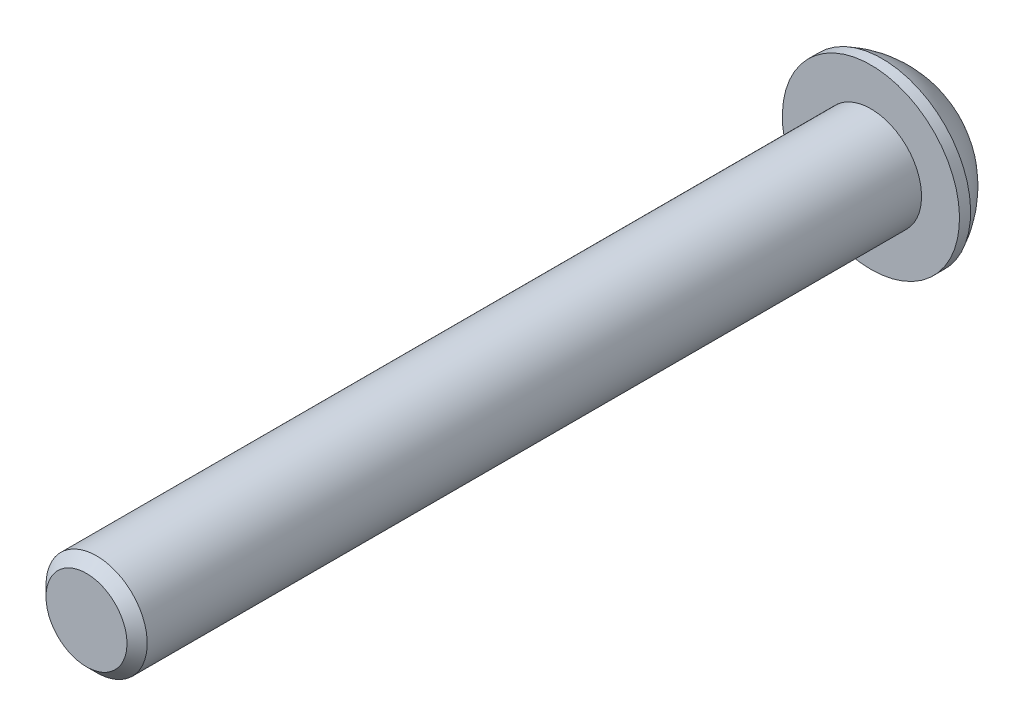
ISO-10303-21;
HEADER;
FILE_DESCRIPTION(('STEP AP214'),'2;1');
FILE_NAME('part.step','',(''),(''),'','','');
FILE_SCHEMA(('AUTOMOTIVE_DESIGN { 1 0 10303 214 1 1 1 1 }'));
ENDSEC;
DATA;
#1=APPLICATION_CONTEXT('core data for automotive mechanical design processes');
#2=APPLICATION_PROTOCOL_DEFINITION('international standard','automotive_design',2000,#1);
#3=PRODUCT_CONTEXT('',#1,'mechanical');
#4=PRODUCT('Part','Part','',(#3));
#5=PRODUCT_RELATED_PRODUCT_CATEGORY('part','',(#4));
#6=PRODUCT_DEFINITION_FORMATION('','',#4);
#7=PRODUCT_DEFINITION_CONTEXT('part definition',#1,'design');
#8=PRODUCT_DEFINITION('design','',#6,#7);
#9=PRODUCT_DEFINITION_SHAPE('','',#8);
#10=(LENGTH_UNIT() NAMED_UNIT(*) SI_UNIT(.MILLI.,.METRE.));
#11=(NAMED_UNIT(*) PLANE_ANGLE_UNIT() SI_UNIT($,.RADIAN.));
#12=(NAMED_UNIT(*) SI_UNIT($,.STERADIAN.) SOLID_ANGLE_UNIT());
#13=UNCERTAINTY_MEASURE_WITH_UNIT(LENGTH_MEASURE(1.E-05),#10,'distance_accuracy_value','');
#14=(GEOMETRIC_REPRESENTATION_CONTEXT(3) GLOBAL_UNCERTAINTY_ASSIGNED_CONTEXT((#13)) GLOBAL_UNIT_ASSIGNED_CONTEXT((#10,
#11,#12)) REPRESENTATION_CONTEXT('',''));
#15=CARTESIAN_POINT('',(0.,0.,0.));
#16=DIRECTION('',(0.,0.,1.));
#17=DIRECTION('',(1.,0.,0.));
#18=AXIS2_PLACEMENT_3D('',#15,#16,#17);
#19=CARTESIAN_POINT('',(0.,0.,0.));
#20=DIRECTION('',(0.,0.,-1.));
#21=DIRECTION('',(-1.,0.,0.));
#22=AXIS2_PLACEMENT_3D('',#19,#20,#21);
#23=CYLINDRICAL_SURFACE('',#22,4.);
#24=CARTESIAN_POINT('',(0.,0.,61.2));
#25=DIRECTION('',(0.,0.,-1.));
#26=DIRECTION('',(-1.,0.,0.));
#27=AXIS2_PLACEMENT_3D('',#24,#25,#26);
#28=CIRCLE('',#27,3.99999999999999);
#29=CARTESIAN_POINT('',(-3.99999999999999,0.,61.2));
#30=VERTEX_POINT('',#29);
#31=EDGE_CURVE('E42',#30,#30,#28,.T.);
#32=ORIENTED_EDGE('',*,*,#31,.T.);
#33=EDGE_LOOP('',(#32));
#34=FACE_BOUND('',#33,.T.);
#35=CARTESIAN_POINT('',(0.,0.,0.));
#36=DIRECTION('',(0.,0.,-1.));
#37=DIRECTION('',(-1.,0.,0.));
#38=AXIS2_PLACEMENT_3D('',#35,#36,#37);
#39=CIRCLE('',#38,4.);
#40=CARTESIAN_POINT('',(-4.,0.,0.));
#41=VERTEX_POINT('',#40);
#42=EDGE_CURVE('E11',#41,#41,#39,.T.);
#43=ORIENTED_EDGE('',*,*,#42,.F.);
#44=EDGE_LOOP('',(#43));
#45=FACE_BOUND('',#44,.T.);
#46=ADVANCED_FACE('F35',(#34,#45),#23,.T.);
#47=CARTESIAN_POINT('',(0.,0.,61.2));
#48=DIRECTION('',(0.,0.,-1.));
#49=DIRECTION('',(-1.,0.,0.));
#50=AXIS2_PLACEMENT_3D('',#47,#48,#49);
#51=CONICAL_SURFACE('',#50,3.99999999999999,0.785398163397446);
#52=CARTESIAN_POINT('',(0.,0.,62.));
#53=DIRECTION('',(0.,0.,-1.));
#54=DIRECTION('',(-1.,0.,0.));
#55=AXIS2_PLACEMENT_3D('',#52,#53,#54);
#56=CIRCLE('',#55,3.2);
#57=CARTESIAN_POINT('',(-3.2,0.,62.));
#58=VERTEX_POINT('',#57);
#59=EDGE_CURVE('E150',#58,#58,#56,.T.);
#60=ORIENTED_EDGE('',*,*,#59,.T.);
#61=EDGE_LOOP('',(#60));
#62=FACE_BOUND('',#61,.T.);
#63=ORIENTED_EDGE('',*,*,#31,.F.);
#64=EDGE_LOOP('',(#63));
#65=FACE_BOUND('',#64,.T.);
#66=ADVANCED_FACE('F157',(#62,#65),#51,.T.);
#67=CARTESIAN_POINT('',(0.,0.,62.));
#68=DIRECTION('',(0.,0.,1.));
#69=DIRECTION('',(1.,0.,0.));
#70=AXIS2_PLACEMENT_3D('',#67,#68,#69);
#71=PLANE('',#70);
#72=ORIENTED_EDGE('',*,*,#59,.F.);
#73=EDGE_LOOP('',(#72));
#74=FACE_BOUND('',#73,.T.);
#75=ADVANCED_FACE('F159',(#74),#71,.T.);
#76=CARTESIAN_POINT('',(0.,0.,0.));
#77=DIRECTION('',(0.,0.,1.));
#78=DIRECTION('',(0.,-1.,0.));
#79=AXIS2_PLACEMENT_3D('',#76,#77,#78);
#80=PLANE('',#79);
#81=ORIENTED_EDGE('',*,*,#42,.T.);
#82=EDGE_LOOP('',(#81));
#83=FACE_BOUND('',#82,.T.);
#84=CARTESIAN_POINT('',(0.,0.,0.));
#85=DIRECTION('',(0.,0.,1.));
#86=DIRECTION('',(0.,-1.,0.));
#87=AXIS2_PLACEMENT_3D('',#84,#85,#86);
#88=CIRCLE('',#87,7.);
#89=CARTESIAN_POINT('',(0.,-7.,0.));
#90=VERTEX_POINT('',#89);
#91=EDGE_CURVE('E147',#90,#90,#88,.T.);
#92=ORIENTED_EDGE('',*,*,#91,.T.);
#93=EDGE_LOOP('',(#92));
#94=FACE_BOUND('',#93,.T.);
#95=ADVANCED_FACE('F165',(#83,#94),#80,.T.);
#96=CARTESIAN_POINT('',(0.,0.,0.));
#97=DIRECTION('',(0.,0.,1.));
#98=DIRECTION('',(0.,-1.,0.));
#99=AXIS2_PLACEMENT_3D('',#96,#97,#98);
#100=CYLINDRICAL_SURFACE('',#99,7.);
#101=CARTESIAN_POINT('',(0.,0.,-0.879999999999999));
#102=DIRECTION('',(0.,0.,1.));
#103=DIRECTION('',(0.,-1.,0.));
#104=AXIS2_PLACEMENT_3D('',#101,#102,#103);
#105=CIRCLE('',#104,7.);
#106=CARTESIAN_POINT('',(0.,-7.,-0.879999999999998));
#107=VERTEX_POINT('',#106);
#108=EDGE_CURVE('E144',#107,#107,#105,.T.);
#109=ORIENTED_EDGE('',*,*,#108,.T.);
#110=EDGE_LOOP('',(#109));
#111=FACE_BOUND('',#110,.T.);
#112=ORIENTED_EDGE('',*,*,#91,.F.);
#113=EDGE_LOOP('',(#112));
#114=FACE_BOUND('',#113,.T.);
#115=ADVANCED_FACE('F171',(#111,#114),#100,.T.);
#116=CARTESIAN_POINT('',(0.,0.,2.58017045454545));
#117=DIRECTION('',(0.,0.,1.));
#118=DIRECTION('',(0.,1.,0.));
#119=AXIS2_PLACEMENT_3D('',#116,#117,#118);
#120=SPHERICAL_SURFACE('',#119,7.80850687228418);
#121=CARTESIAN_POINT('',(0.,0.,-4.4));
#122=DIRECTION('',(0.,0.,1.));
#123=DIRECTION('',(0.,-1.,0.));
#124=AXIS2_PLACEMENT_3D('',#121,#122,#123);
#125=CIRCLE('',#124,3.50000000000001);
#126=CARTESIAN_POINT('',(0.,-3.50000000000001,-4.4));
#127=VERTEX_POINT('',#126);
#128=EDGE_CURVE('E136',#127,#127,#125,.T.);
#129=ORIENTED_EDGE('',*,*,#128,.T.);
#130=EDGE_LOOP('',(#129));
#131=FACE_BOUND('',#130,.T.);
#132=ORIENTED_EDGE('',*,*,#108,.F.);
#133=EDGE_LOOP('',(#132));
#134=FACE_BOUND('',#133,.T.);
#135=ADVANCED_FACE('F175',(#131,#134),#120,.T.);
#136=CARTESIAN_POINT('',(0.,3.5,-4.4));
#137=DIRECTION('',(0.,0.,-1.));
#138=DIRECTION('',(0.,1.,0.));
#139=AXIS2_PLACEMENT_3D('',#136,#137,#138);
#140=PLANE('',#139);
#141=DIRECTION('',(0.5,0.866025403784438,0.));
#142=VECTOR('',#141,1.);
#143=CARTESIAN_POINT('',(-2.88675134594813,0.,-4.4));
#144=LINE('',#143,#142);
#145=CARTESIAN_POINT('',(-2.88675134594813,0.,-4.4));
#146=VERTEX_POINT('',#145);
#147=CARTESIAN_POINT('',(-1.44337567297406,2.5,-4.4));
#148=VERTEX_POINT('',#147);
#149=EDGE_CURVE('E49',#146,#148,#144,.T.);
#150=ORIENTED_EDGE('',*,*,#149,.F.);
#151=DIRECTION('',(-0.5,0.866025403784439,0.));
#152=VECTOR('',#151,1.);
#153=CARTESIAN_POINT('',(-1.44337567297406,-2.5,-4.4));
#154=LINE('',#153,#152);
#155=CARTESIAN_POINT('',(-1.44337567297406,-2.5,-4.4));
#156=VERTEX_POINT('',#155);
#157=EDGE_CURVE('E132',#156,#146,#154,.T.);
#158=ORIENTED_EDGE('',*,*,#157,.F.);
#159=DIRECTION('',(-1.,0.,0.));
#160=VECTOR('',#159,1.);
#161=CARTESIAN_POINT('',(1.44337567297406,-2.5,-4.4));
#162=LINE('',#161,#160);
#163=CARTESIAN_POINT('',(1.44337567297406,-2.5,-4.4));
#164=VERTEX_POINT('',#163);
#165=EDGE_CURVE('E130',#164,#156,#162,.T.);
#166=ORIENTED_EDGE('',*,*,#165,.F.);
#167=DIRECTION('',(-0.5,-0.866025403784439,0.));
#168=VECTOR('',#167,1.);
#169=CARTESIAN_POINT('',(2.88675134594813,0.,-4.4));
#170=LINE('',#169,#168);
#171=CARTESIAN_POINT('',(2.88675134594813,0.,-4.4));
#172=VERTEX_POINT('',#171);
#173=EDGE_CURVE('E97',#172,#164,#170,.T.);
#174=ORIENTED_EDGE('',*,*,#173,.F.);
#175=DIRECTION('',(0.5,-0.866025403784439,0.));
#176=VECTOR('',#175,1.);
#177=CARTESIAN_POINT('',(1.44337567297406,2.5,-4.4));
#178=LINE('',#177,#176);
#179=CARTESIAN_POINT('',(1.44337567297406,2.5,-4.4));
#180=VERTEX_POINT('',#179);
#181=EDGE_CURVE('E126',#180,#172,#178,.T.);
#182=ORIENTED_EDGE('',*,*,#181,.F.);
#183=DIRECTION('',(1.,0.,0.));
#184=VECTOR('',#183,1.);
#185=CARTESIAN_POINT('',(-1.44337567297406,2.5,-4.4));
#186=LINE('',#185,#184);
#187=EDGE_CURVE('E123',#148,#180,#186,.T.);
#188=ORIENTED_EDGE('',*,*,#187,.F.);
#189=EDGE_LOOP('',(#150,#158,#166,#174,#182,#188));
#190=FACE_BOUND('',#189,.T.);
#191=ORIENTED_EDGE('',*,*,#128,.F.);
#192=EDGE_LOOP('',(#191));
#193=FACE_BOUND('',#192,.T.);
#194=ADVANCED_FACE('F179',(#190,#193),#140,.T.);
#195=CARTESIAN_POINT('',(-2.88675134594813,0.,-1.584));
#196=DIRECTION('',(-0.866025403784438,0.5,0.));
#197=DIRECTION('',(-0.5,-0.866025403784439,0.));
#198=AXIS2_PLACEMENT_3D('',#195,#196,#197);
#199=PLANE('',#198);
#200=ORIENTED_EDGE('',*,*,#149,.T.);
#201=DIRECTION('',(0.,0.,-1.));
#202=VECTOR('',#201,1.);
#203=CARTESIAN_POINT('',(-1.44337567297406,2.5,-1.584));
#204=LINE('',#203,#202);
#205=CARTESIAN_POINT('',(-1.44337567297406,2.5,-1.584));
#206=VERTEX_POINT('',#205);
#207=EDGE_CURVE('E79',#206,#148,#204,.T.);
#208=ORIENTED_EDGE('',*,*,#207,.F.);
#209=DIRECTION('',(0.5,0.866025403784438,0.));
#210=VECTOR('',#209,1.);
#211=CARTESIAN_POINT('',(-2.88675134594813,0.,-1.584));
#212=LINE('',#211,#210);
#213=CARTESIAN_POINT('',(-2.88675134594813,0.,-1.584));
#214=VERTEX_POINT('',#213);
#215=EDGE_CURVE('E134',#214,#206,#212,.T.);
#216=ORIENTED_EDGE('',*,*,#215,.F.);
#217=DIRECTION('',(0.,0.,-1.));
#218=VECTOR('',#217,1.);
#219=CARTESIAN_POINT('',(-2.88675134594813,0.,-1.584));
#220=LINE('',#219,#218);
#221=EDGE_CURVE('E57',#214,#146,#220,.T.);
#222=ORIENTED_EDGE('',*,*,#221,.T.);
#223=EDGE_LOOP('',(#200,#208,#216,#222));
#224=FACE_BOUND('',#223,.T.);
#225=ADVANCED_FACE('F183',(#224),#199,.F.);
#226=CARTESIAN_POINT('',(-1.44337567297407,-2.5,-1.584));
#227=DIRECTION('',(-0.866025403784439,-0.5,0.));
#228=DIRECTION('',(0.5,-0.866025403784439,0.));
#229=AXIS2_PLACEMENT_3D('',#226,#227,#228);
#230=PLANE('',#229);
#231=ORIENTED_EDGE('',*,*,#157,.T.);
#232=ORIENTED_EDGE('',*,*,#221,.F.);
#233=DIRECTION('',(-0.5,0.866025403784439,0.));
#234=VECTOR('',#233,1.);
#235=CARTESIAN_POINT('',(-1.44337567297407,-2.5,-1.584));
#236=LINE('',#235,#234);
#237=CARTESIAN_POINT('',(-1.44337567297407,-2.5,-1.584));
#238=VERTEX_POINT('',#237);
#239=EDGE_CURVE('E109',#238,#214,#236,.T.);
#240=ORIENTED_EDGE('',*,*,#239,.F.);
#241=DIRECTION('',(0.,0.,-1.));
#242=VECTOR('',#241,1.);
#243=CARTESIAN_POINT('',(-1.44337567297407,-2.5,-1.584));
#244=LINE('',#243,#242);
#245=EDGE_CURVE('E101',#238,#156,#244,.T.);
#246=ORIENTED_EDGE('',*,*,#245,.T.);
#247=EDGE_LOOP('',(#231,#232,#240,#246));
#248=FACE_BOUND('',#247,.T.);
#249=ADVANCED_FACE('F187',(#248),#230,.F.);
#250=CARTESIAN_POINT('',(1.44337567297406,-2.5,-1.584));
#251=DIRECTION('',(0.,-1.,0.));
#252=DIRECTION('',(1.,0.,0.));
#253=AXIS2_PLACEMENT_3D('',#250,#251,#252);
#254=PLANE('',#253);
#255=ORIENTED_EDGE('',*,*,#165,.T.);
#256=ORIENTED_EDGE('',*,*,#245,.F.);
#257=DIRECTION('',(-1.,0.,0.));
#258=VECTOR('',#257,1.);
#259=CARTESIAN_POINT('',(1.44337567297406,-2.5,-1.584));
#260=LINE('',#259,#258);
#261=CARTESIAN_POINT('',(1.44337567297406,-2.5,-1.584));
#262=VERTEX_POINT('',#261);
#263=EDGE_CURVE('E105',#262,#238,#260,.T.);
#264=ORIENTED_EDGE('',*,*,#263,.F.);
#265=DIRECTION('',(0.,0.,-1.));
#266=VECTOR('',#265,1.);
#267=CARTESIAN_POINT('',(1.44337567297406,-2.5,-1.584));
#268=LINE('',#267,#266);
#269=EDGE_CURVE('E90',#262,#164,#268,.T.);
#270=ORIENTED_EDGE('',*,*,#269,.T.);
#271=EDGE_LOOP('',(#255,#256,#264,#270));
#272=FACE_BOUND('',#271,.T.);
#273=ADVANCED_FACE('F106',(#272),#254,.F.);
#274=CARTESIAN_POINT('',(2.88675134594813,0.,-1.584));
#275=DIRECTION('',(0.866025403784439,-0.5,0.));
#276=DIRECTION('',(0.5,0.866025403784439,0.));
#277=AXIS2_PLACEMENT_3D('',#274,#275,#276);
#278=PLANE('',#277);
#279=ORIENTED_EDGE('',*,*,#173,.T.);
#280=ORIENTED_EDGE('',*,*,#269,.F.);
#281=DIRECTION('',(-0.5,-0.866025403784439,0.));
#282=VECTOR('',#281,1.);
#283=CARTESIAN_POINT('',(2.88675134594813,0.,-1.584));
#284=LINE('',#283,#282);
#285=CARTESIAN_POINT('',(2.88675134594813,0.,-1.584));
#286=VERTEX_POINT('',#285);
#287=EDGE_CURVE('E94',#286,#262,#284,.T.);
#288=ORIENTED_EDGE('',*,*,#287,.F.);
#289=DIRECTION('',(0.,0.,-1.));
#290=VECTOR('',#289,1.);
#291=CARTESIAN_POINT('',(2.88675134594813,0.,-1.584));
#292=LINE('',#291,#290);
#293=EDGE_CURVE('E102',#286,#172,#292,.T.);
#294=ORIENTED_EDGE('',*,*,#293,.T.);
#295=EDGE_LOOP('',(#279,#280,#288,#294));
#296=FACE_BOUND('',#295,.T.);
#297=ADVANCED_FACE('F92',(#296),#278,.F.);
#298=CARTESIAN_POINT('',(1.44337567297406,2.5,-1.584));
#299=DIRECTION('',(0.866025403784439,0.5,0.));
#300=DIRECTION('',(-0.5,0.866025403784439,0.));
#301=AXIS2_PLACEMENT_3D('',#298,#299,#300);
#302=PLANE('',#301);
#303=ORIENTED_EDGE('',*,*,#181,.T.);
#304=ORIENTED_EDGE('',*,*,#293,.F.);
#305=DIRECTION('',(0.5,-0.866025403784439,0.));
#306=VECTOR('',#305,1.);
#307=CARTESIAN_POINT('',(1.44337567297406,2.5,-1.584));
#308=LINE('',#307,#306);
#309=CARTESIAN_POINT('',(1.44337567297406,2.5,-1.584));
#310=VERTEX_POINT('',#309);
#311=EDGE_CURVE('E115',#310,#286,#308,.T.);
#312=ORIENTED_EDGE('',*,*,#311,.F.);
#313=DIRECTION('',(0.,0.,-1.));
#314=VECTOR('',#313,1.);
#315=CARTESIAN_POINT('',(1.44337567297406,2.5,-1.584));
#316=LINE('',#315,#314);
#317=EDGE_CURVE('E139',#310,#180,#316,.T.);
#318=ORIENTED_EDGE('',*,*,#317,.T.);
#319=EDGE_LOOP('',(#303,#304,#312,#318));
#320=FACE_BOUND('',#319,.T.);
#321=ADVANCED_FACE('F191',(#320),#302,.F.);
#322=CARTESIAN_POINT('',(-1.44337567297406,2.5,-1.584));
#323=DIRECTION('',(0.,1.,0.));
#324=DIRECTION('',(-1.,0.,0.));
#325=AXIS2_PLACEMENT_3D('',#322,#323,#324);
#326=PLANE('',#325);
#327=ORIENTED_EDGE('',*,*,#187,.T.);
#328=ORIENTED_EDGE('',*,*,#317,.F.);
#329=DIRECTION('',(1.,0.,0.));
#330=VECTOR('',#329,1.);
#331=CARTESIAN_POINT('',(-1.44337567297406,2.5,-1.584));
#332=LINE('',#331,#330);
#333=EDGE_CURVE('E117',#206,#310,#332,.T.);
#334=ORIENTED_EDGE('',*,*,#333,.F.);
#335=ORIENTED_EDGE('',*,*,#207,.T.);
#336=EDGE_LOOP('',(#327,#328,#334,#335));
#337=FACE_BOUND('',#336,.T.);
#338=ADVANCED_FACE('F188',(#337),#326,.F.);
#339=CARTESIAN_POINT('',(-2.88675134594813,0.,-1.584));
#340=DIRECTION('',(0.,0.,1.));
#341=DIRECTION('',(1.,0.,0.));
#342=AXIS2_PLACEMENT_3D('',#339,#340,#341);
#343=PLANE('',#342);
#344=ORIENTED_EDGE('',*,*,#215,.T.);
#345=ORIENTED_EDGE('',*,*,#333,.T.);
#346=ORIENTED_EDGE('',*,*,#311,.T.);
#347=ORIENTED_EDGE('',*,*,#287,.T.);
#348=ORIENTED_EDGE('',*,*,#263,.T.);
#349=ORIENTED_EDGE('',*,*,#239,.T.);
#350=EDGE_LOOP('',(#344,#345,#346,#347,#348,#349));
#351=FACE_BOUND('',#350,.T.);
#352=ADVANCED_FACE('F112',(#351),#343,.F.);
#353=CLOSED_SHELL('',(#46,#66,#75,#95,#115,#135,#194,#225,#249,#273,#297,#321,#338,#352));
#354=MANIFOLD_SOLID_BREP('B2',#353);
#355=ADVANCED_BREP_SHAPE_REPRESENTATION('',(#18,#354),#14);
#356=SHAPE_DEFINITION_REPRESENTATION(#9,#355);
ENDSEC;
END-ISO-10303-21;
